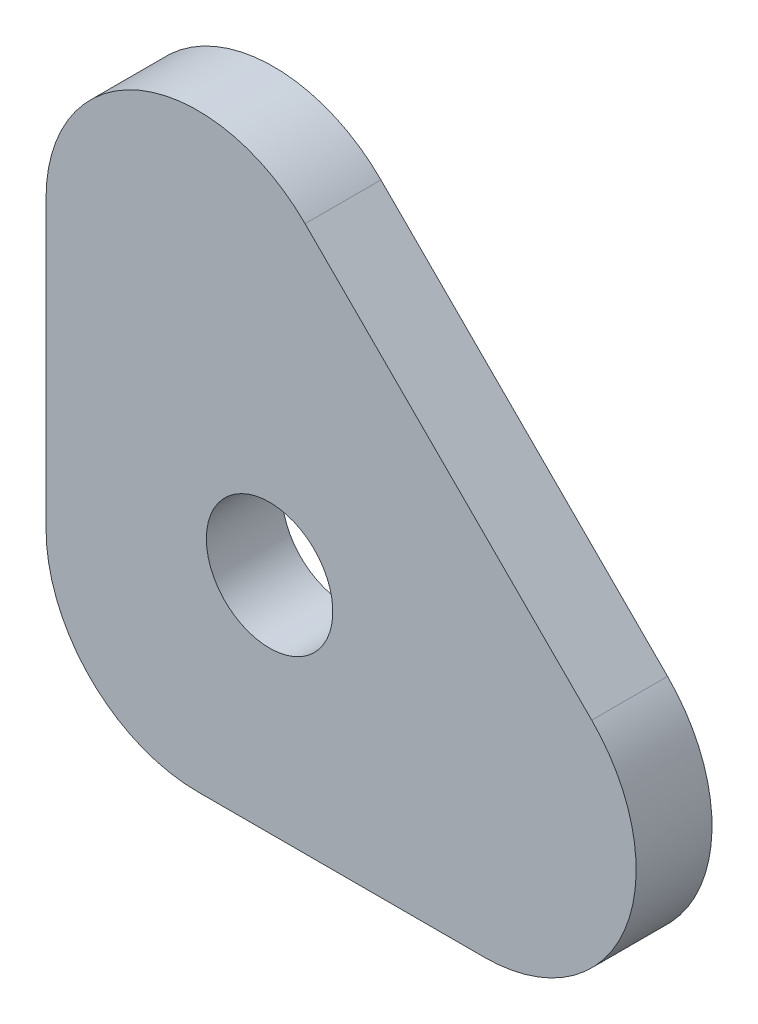
ISO-10303-21;
HEADER;
FILE_DESCRIPTION(('STEP AP214'),'2;1');
FILE_NAME('part.step','',(''),(''),'','','');
FILE_SCHEMA(('AUTOMOTIVE_DESIGN { 1 0 10303 214 1 1 1 1 }'));
ENDSEC;
DATA;
#1=APPLICATION_CONTEXT('core data for automotive mechanical design processes');
#2=APPLICATION_PROTOCOL_DEFINITION('international standard','automotive_design',2000,#1);
#3=PRODUCT_CONTEXT('',#1,'mechanical');
#4=PRODUCT('Part','Part','',(#3));
#5=PRODUCT_RELATED_PRODUCT_CATEGORY('part','',(#4));
#6=PRODUCT_DEFINITION_FORMATION('','',#4);
#7=PRODUCT_DEFINITION_CONTEXT('part definition',#1,'design');
#8=PRODUCT_DEFINITION('design','',#6,#7);
#9=PRODUCT_DEFINITION_SHAPE('','',#8);
#10=(LENGTH_UNIT() NAMED_UNIT(*) SI_UNIT(.MILLI.,.METRE.));
#11=(NAMED_UNIT(*) PLANE_ANGLE_UNIT() SI_UNIT($,.RADIAN.));
#12=(NAMED_UNIT(*) SI_UNIT($,.STERADIAN.) SOLID_ANGLE_UNIT());
#13=UNCERTAINTY_MEASURE_WITH_UNIT(LENGTH_MEASURE(1.E-05),#10,'distance_accuracy_value','');
#14=(GEOMETRIC_REPRESENTATION_CONTEXT(3) GLOBAL_UNCERTAINTY_ASSIGNED_CONTEXT((#13)) GLOBAL_UNIT_ASSIGNED_CONTEXT((#10,
#11,#12)) REPRESENTATION_CONTEXT('',''));
#15=CARTESIAN_POINT('',(0.,0.,0.));
#16=DIRECTION('',(0.,0.,1.));
#17=DIRECTION('',(1.,0.,0.));
#18=AXIS2_PLACEMENT_3D('',#15,#16,#17);
#19=CARTESIAN_POINT('',(-296.441125496244,-290921.250000001,-53.));
#20=DIRECTION('',(-1.,0.,0.));
#21=DIRECTION('',(0.,-1.,0.));
#22=AXIS2_PLACEMENT_3D('',#19,#20,#21);
#23=PLANE('',#22);
#24=DIRECTION('',(0.,1.,0.));
#25=VECTOR('',#24,1.);
#26=CARTESIAN_POINT('',(-296.441125496244,-290921.250000001,-59.));
#27=LINE('',#26,#25);
#28=CARTESIAN_POINT('',(-296.441125496955,-284.441125496983,-59.));
#29=VERTEX_POINT('',#28);
#30=CARTESIAN_POINT('',(-296.441125496955,-261.772077938645,-59.));
#31=VERTEX_POINT('',#30);
#32=EDGE_CURVE('E119',#29,#31,#27,.T.);
#33=ORIENTED_EDGE('',*,*,#32,.F.);
#34=DIRECTION('',(0.,0.,-1.));
#35=VECTOR('',#34,1.);
#36=CARTESIAN_POINT('',(-296.441125496955,-284.441125496983,-53.));
#37=LINE('',#36,#35);
#38=CARTESIAN_POINT('',(-296.441125496955,-284.441125496983,-53.));
#39=VERTEX_POINT('',#38);
#40=EDGE_CURVE('E11',#39,#29,#37,.T.);
#41=ORIENTED_EDGE('',*,*,#40,.F.);
#42=DIRECTION('',(0.,1.,0.));
#43=VECTOR('',#42,1.);
#44=CARTESIAN_POINT('',(-296.441125496244,-290921.250000001,-53.));
#45=LINE('',#44,#43);
#46=CARTESIAN_POINT('',(-296.441125496955,-261.772077938645,-53.));
#47=VERTEX_POINT('',#46);
#48=EDGE_CURVE('E134',#39,#47,#45,.T.);
#49=ORIENTED_EDGE('',*,*,#48,.T.);
#50=DIRECTION('',(0.,0.,-1.));
#51=VECTOR('',#50,1.);
#52=CARTESIAN_POINT('',(-296.441125496955,-261.772077938645,-53.));
#53=LINE('',#52,#51);
#54=EDGE_CURVE('E37',#47,#31,#53,.T.);
#55=ORIENTED_EDGE('',*,*,#54,.T.);
#56=EDGE_LOOP('',(#33,#41,#49,#55));
#57=FACE_BOUND('',#56,.T.);
#58=ADVANCED_FACE('F34',(#57),#23,.T.);
#59=CARTESIAN_POINT('',(-284.441125496955,-284.441125496953,-53.));
#60=DIRECTION('',(0.,0.,-1.));
#61=DIRECTION('',(-1.,0.,0.));
#62=AXIS2_PLACEMENT_3D('',#59,#60,#61);
#63=CYLINDRICAL_SURFACE('',#62,12.);
#64=CARTESIAN_POINT('',(-284.441125496955,-284.441125496953,-59.));
#65=DIRECTION('',(0.,0.,-1.));
#66=DIRECTION('',(-1.,0.,0.));
#67=AXIS2_PLACEMENT_3D('',#64,#65,#66);
#68=CIRCLE('',#67,12.);
#69=CARTESIAN_POINT('',(-284.441125496983,-296.441125496953,-59.));
#70=VERTEX_POINT('',#69);
#71=EDGE_CURVE('E132',#70,#29,#68,.T.);
#72=ORIENTED_EDGE('',*,*,#71,.F.);
#73=DIRECTION('',(0.,0.,-1.));
#74=VECTOR('',#73,1.);
#75=CARTESIAN_POINT('',(-284.441125496983,-296.441125496953,-53.));
#76=LINE('',#75,#74);
#77=CARTESIAN_POINT('',(-284.441125496983,-296.441125496953,-53.));
#78=VERTEX_POINT('',#77);
#79=EDGE_CURVE('E43',#78,#70,#76,.T.);
#80=ORIENTED_EDGE('',*,*,#79,.F.);
#81=CARTESIAN_POINT('',(-284.441125496955,-284.441125496953,-53.));
#82=DIRECTION('',(0.,0.,-1.));
#83=DIRECTION('',(-1.,0.,0.));
#84=AXIS2_PLACEMENT_3D('',#81,#82,#83);
#85=CIRCLE('',#84,12.);
#86=EDGE_CURVE('E109',#78,#39,#85,.T.);
#87=ORIENTED_EDGE('',*,*,#86,.T.);
#88=ORIENTED_EDGE('',*,*,#40,.T.);
#89=EDGE_LOOP('',(#72,#80,#87,#88));
#90=FACE_BOUND('',#89,.T.);
#91=ADVANCED_FACE('F142',(#90),#63,.T.);
#92=CARTESIAN_POINT('',(399912.500000001,-296.441125497893,-53.));
#93=DIRECTION('',(0.,-1.,0.));
#94=DIRECTION('',(1.,0.,0.));
#95=AXIS2_PLACEMENT_3D('',#92,#93,#94);
#96=PLANE('',#95);
#97=DIRECTION('',(-1.,0.,0.));
#98=VECTOR('',#97,1.);
#99=CARTESIAN_POINT('',(399912.500000001,-296.441125497893,-59.));
#100=LINE('',#99,#98);
#101=CARTESIAN_POINT('',(-261.772077938645,-296.441125496913,-59.));
#102=VERTEX_POINT('',#101);
#103=EDGE_CURVE('E96',#102,#70,#100,.T.);
#104=ORIENTED_EDGE('',*,*,#103,.F.);
#105=DIRECTION('',(0.,0.,-1.));
#106=VECTOR('',#105,1.);
#107=CARTESIAN_POINT('',(-261.772077938645,-296.441125496913,-53.));
#108=LINE('',#107,#106);
#109=CARTESIAN_POINT('',(-261.772077938645,-296.441125496913,-53.));
#110=VERTEX_POINT('',#109);
#111=EDGE_CURVE('E91',#110,#102,#108,.T.);
#112=ORIENTED_EDGE('',*,*,#111,.F.);
#113=DIRECTION('',(-1.,0.,0.));
#114=VECTOR('',#113,1.);
#115=CARTESIAN_POINT('',(399912.500000001,-296.441125497893,-53.));
#116=LINE('',#115,#114);
#117=EDGE_CURVE('E94',#110,#78,#116,.T.);
#118=ORIENTED_EDGE('',*,*,#117,.T.);
#119=ORIENTED_EDGE('',*,*,#79,.T.);
#120=EDGE_LOOP('',(#104,#112,#118,#119));
#121=FACE_BOUND('',#120,.T.);
#122=ADVANCED_FACE('F93',(#121),#96,.T.);
#123=CARTESIAN_POINT('',(-261.772077938643,-284.441125496953,-53.));
#124=DIRECTION('',(0.,0.,-1.));
#125=DIRECTION('',(-1.,0.,0.));
#126=AXIS2_PLACEMENT_3D('',#123,#124,#125);
#127=CYLINDRICAL_SURFACE('',#126,12.);
#128=CARTESIAN_POINT('',(-261.772077938643,-284.441125496953,-59.));
#129=DIRECTION('',(0.,0.,-1.));
#130=DIRECTION('',(-1.,0.,0.));
#131=AXIS2_PLACEMENT_3D('',#128,#129,#130);
#132=CIRCLE('',#131,12.);
#133=CARTESIAN_POINT('',(-253.286796564448,-275.955844122672,-59.));
#134=VERTEX_POINT('',#133);
#135=EDGE_CURVE('E129',#134,#102,#132,.T.);
#136=ORIENTED_EDGE('',*,*,#135,.F.);
#137=DIRECTION('',(0.,0.,-1.));
#138=VECTOR('',#137,1.);
#139=CARTESIAN_POINT('',(-253.286796564448,-275.955844122672,-53.));
#140=LINE('',#139,#138);
#141=CARTESIAN_POINT('',(-253.286796564448,-275.955844122672,-53.));
#142=VERTEX_POINT('',#141);
#143=EDGE_CURVE('E101',#142,#134,#140,.T.);
#144=ORIENTED_EDGE('',*,*,#143,.F.);
#145=CARTESIAN_POINT('',(-261.772077938643,-284.441125496953,-53.));
#146=DIRECTION('',(0.,0.,-1.));
#147=DIRECTION('',(-1.,0.,0.));
#148=AXIS2_PLACEMENT_3D('',#145,#146,#147);
#149=CIRCLE('',#148,12.);
#150=EDGE_CURVE('E107',#142,#110,#149,.T.);
#151=ORIENTED_EDGE('',*,*,#150,.T.);
#152=ORIENTED_EDGE('',*,*,#111,.T.);
#153=EDGE_LOOP('',(#136,#144,#151,#152));
#154=FACE_BOUND('',#153,.T.);
#155=ADVANCED_FACE('F111',(#154),#127,.T.);
#156=CARTESIAN_POINT('',(345152.253679656,-345681.496320344,-53.));
#157=DIRECTION('',(0.707106781186547,0.707106781186547,0.));
#158=DIRECTION('',(-0.707106781186548,0.707106781186548,0.));
#159=AXIS2_PLACEMENT_3D('',#156,#157,#158);
#160=PLANE('',#159);
#161=DIRECTION('',(0.707106781186548,-0.707106781186548,0.));
#162=VECTOR('',#161,1.);
#163=CARTESIAN_POINT('',(345152.253679656,-345681.496320344,-59.));
#164=LINE('',#163,#162);
#165=CARTESIAN_POINT('',(-275.955844122791,-253.286796564339,-59.));
#166=VERTEX_POINT('',#165);
#167=EDGE_CURVE('E126',#166,#134,#164,.T.);
#168=ORIENTED_EDGE('',*,*,#167,.F.);
#169=DIRECTION('',(0.,0.,-1.));
#170=VECTOR('',#169,1.);
#171=CARTESIAN_POINT('',(-275.955844122791,-253.286796564339,-53.));
#172=LINE('',#171,#170);
#173=CARTESIAN_POINT('',(-275.955844122791,-253.286796564339,-53.));
#174=VERTEX_POINT('',#173);
#175=EDGE_CURVE('E137',#174,#166,#172,.T.);
#176=ORIENTED_EDGE('',*,*,#175,.F.);
#177=DIRECTION('',(0.707106781186548,-0.707106781186548,0.));
#178=VECTOR('',#177,1.);
#179=CARTESIAN_POINT('',(345152.253679656,-345681.496320344,-53.));
#180=LINE('',#179,#178);
#181=EDGE_CURVE('E112',#174,#142,#180,.T.);
#182=ORIENTED_EDGE('',*,*,#181,.T.);
#183=ORIENTED_EDGE('',*,*,#143,.T.);
#184=EDGE_LOOP('',(#168,#176,#182,#183));
#185=FACE_BOUND('',#184,.T.);
#186=ADVANCED_FACE('F155',(#185),#160,.T.);
#187=CARTESIAN_POINT('',(-284.441125496955,-261.772077938641,-53.));
#188=DIRECTION('',(0.,0.,-1.));
#189=DIRECTION('',(-1.,0.,0.));
#190=AXIS2_PLACEMENT_3D('',#187,#188,#189);
#191=CYLINDRICAL_SURFACE('',#190,12.);
#192=CARTESIAN_POINT('',(-284.441125496955,-261.772077938641,-59.));
#193=DIRECTION('',(0.,0.,-1.));
#194=DIRECTION('',(-1.,0.,0.));
#195=AXIS2_PLACEMENT_3D('',#192,#193,#194);
#196=CIRCLE('',#195,12.);
#197=EDGE_CURVE('E122',#31,#166,#196,.T.);
#198=ORIENTED_EDGE('',*,*,#197,.F.);
#199=ORIENTED_EDGE('',*,*,#54,.F.);
#200=CARTESIAN_POINT('',(-284.441125496955,-261.772077938641,-53.));
#201=DIRECTION('',(0.,0.,-1.));
#202=DIRECTION('',(-1.,0.,0.));
#203=AXIS2_PLACEMENT_3D('',#200,#201,#202);
#204=CIRCLE('',#203,12.);
#205=EDGE_CURVE('E114',#47,#174,#204,.T.);
#206=ORIENTED_EDGE('',*,*,#205,.T.);
#207=ORIENTED_EDGE('',*,*,#175,.T.);
#208=EDGE_LOOP('',(#198,#199,#206,#207));
#209=FACE_BOUND('',#208,.T.);
#210=ADVANCED_FACE('F139',(#209),#191,.T.);
#211=CARTESIAN_POINT('',(-284.441125496955,-261.772077938641,-53.));
#212=DIRECTION('',(0.,0.,-1.));
#213=DIRECTION('',(-1.,0.,0.));
#214=AXIS2_PLACEMENT_3D('',#211,#212,#213);
#215=PLANE('',#214);
#216=CARTESIAN_POINT('',(-278.763455967292,-278.76345596729,-53.));
#217=DIRECTION('',(0.,0.,-1.));
#218=DIRECTION('',(-1.,0.,0.));
#219=AXIS2_PLACEMENT_3D('',#216,#217,#218);
#220=CIRCLE('',#219,4.99999999999999);
#221=CARTESIAN_POINT('',(-283.763455967292,-278.76345596729,-53.));
#222=VERTEX_POINT('',#221);
#223=EDGE_CURVE('E123',#222,#222,#220,.T.);
#224=ORIENTED_EDGE('',*,*,#223,.T.);
#225=EDGE_LOOP('',(#224));
#226=FACE_BOUND('',#225,.T.);
#227=ORIENTED_EDGE('',*,*,#48,.F.);
#228=ORIENTED_EDGE('',*,*,#86,.F.);
#229=ORIENTED_EDGE('',*,*,#117,.F.);
#230=ORIENTED_EDGE('',*,*,#150,.F.);
#231=ORIENTED_EDGE('',*,*,#181,.F.);
#232=ORIENTED_EDGE('',*,*,#205,.F.);
#233=EDGE_LOOP('',(#227,#228,#229,#230,#231,#232));
#234=FACE_BOUND('',#233,.T.);
#235=ADVANCED_FACE('F105',(#226,#234),#215,.F.);
#236=CARTESIAN_POINT('',(-284.441125496955,-261.772077938641,-59.));
#237=DIRECTION('',(0.,0.,-1.));
#238=DIRECTION('',(-1.,0.,0.));
#239=AXIS2_PLACEMENT_3D('',#236,#237,#238);
#240=PLANE('',#239);
#241=CARTESIAN_POINT('',(-278.763455967292,-278.76345596729,-59.));
#242=DIRECTION('',(0.,0.,-1.));
#243=DIRECTION('',(-1.,0.,0.));
#244=AXIS2_PLACEMENT_3D('',#241,#242,#243);
#245=CIRCLE('',#244,4.99999999999999);
#246=CARTESIAN_POINT('',(-283.763455967292,-278.76345596729,-59.));
#247=VERTEX_POINT('',#246);
#248=EDGE_CURVE('E178',#247,#247,#245,.T.);
#249=ORIENTED_EDGE('',*,*,#248,.F.);
#250=EDGE_LOOP('',(#249));
#251=FACE_BOUND('',#250,.T.);
#252=ORIENTED_EDGE('',*,*,#32,.T.);
#253=ORIENTED_EDGE('',*,*,#197,.T.);
#254=ORIENTED_EDGE('',*,*,#167,.T.);
#255=ORIENTED_EDGE('',*,*,#135,.T.);
#256=ORIENTED_EDGE('',*,*,#103,.T.);
#257=ORIENTED_EDGE('',*,*,#71,.T.);
#258=EDGE_LOOP('',(#252,#253,#254,#255,#256,#257));
#259=FACE_BOUND('',#258,.T.);
#260=ADVANCED_FACE('F141',(#251,#259),#240,.T.);
#261=CARTESIAN_POINT('',(-278.763455967292,-278.76345596729,-53.));
#262=DIRECTION('',(0.,0.,-1.));
#263=DIRECTION('',(-1.,0.,0.));
#264=AXIS2_PLACEMENT_3D('',#261,#262,#263);
#265=CYLINDRICAL_SURFACE('',#264,4.99999999999999);
#266=ORIENTED_EDGE('',*,*,#223,.F.);
#267=EDGE_LOOP('',(#266));
#268=FACE_BOUND('',#267,.T.);
#269=ORIENTED_EDGE('',*,*,#248,.T.);
#270=EDGE_LOOP('',(#269));
#271=FACE_BOUND('',#270,.T.);
#272=ADVANCED_FACE('F166',(#268,#271),#265,.F.);
#273=CLOSED_SHELL('',(#58,#91,#122,#155,#186,#210,#235,#260,#272));
#274=MANIFOLD_SOLID_BREP('B2',#273);
#275=ADVANCED_BREP_SHAPE_REPRESENTATION('',(#18,#274),#14);
#276=SHAPE_DEFINITION_REPRESENTATION(#9,#275);
ENDSEC;
END-ISO-10303-21;
